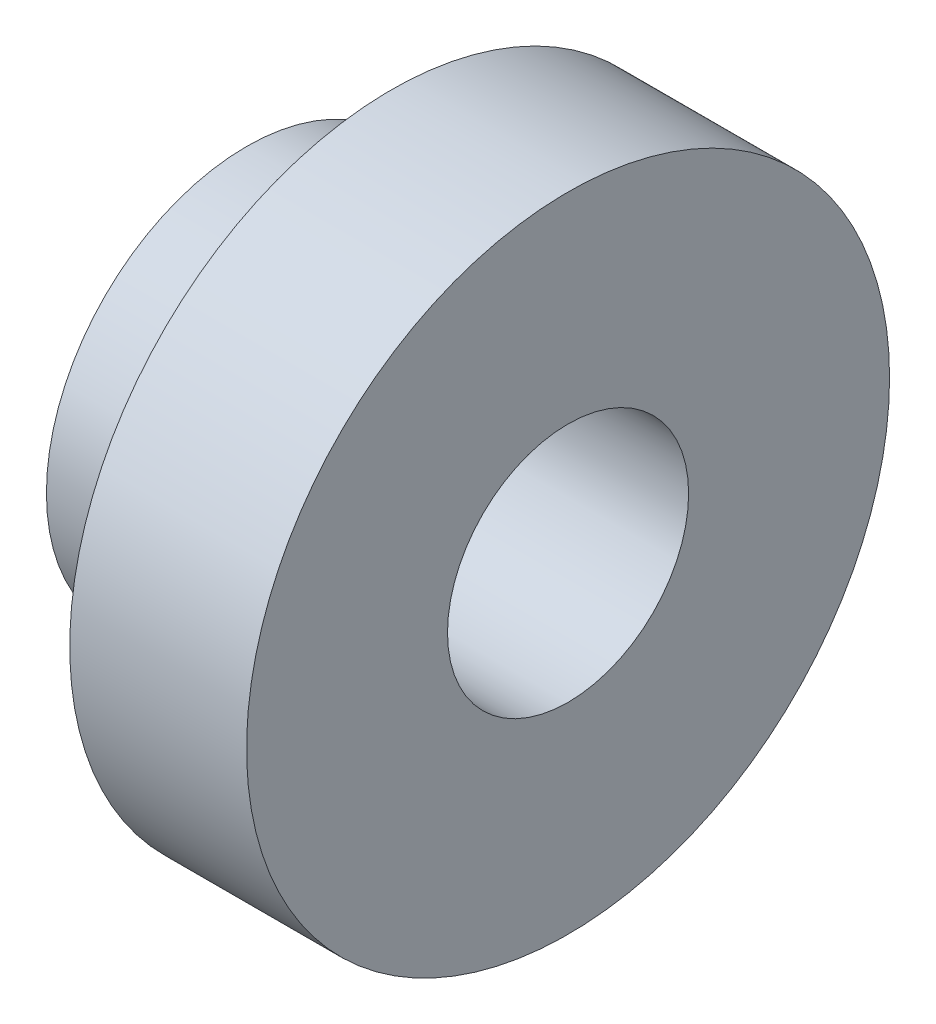
ISO-10303-21;
HEADER;
FILE_DESCRIPTION(('STEP AP214'),'2;1');
FILE_NAME('part.step','',(''),(''),'','','');
FILE_SCHEMA(('AUTOMOTIVE_DESIGN { 1 0 10303 214 1 1 1 1 }'));
ENDSEC;
DATA;
#1=APPLICATION_CONTEXT('core data for automotive mechanical design processes');
#2=APPLICATION_PROTOCOL_DEFINITION('international standard','automotive_design',2000,#1);
#3=PRODUCT_CONTEXT('',#1,'mechanical');
#4=PRODUCT('Part','Part','',(#3));
#5=PRODUCT_RELATED_PRODUCT_CATEGORY('part','',(#4));
#6=PRODUCT_DEFINITION_FORMATION('','',#4);
#7=PRODUCT_DEFINITION_CONTEXT('part definition',#1,'design');
#8=PRODUCT_DEFINITION('design','',#6,#7);
#9=PRODUCT_DEFINITION_SHAPE('','',#8);
#10=(LENGTH_UNIT() NAMED_UNIT(*) SI_UNIT(.MILLI.,.METRE.));
#11=(NAMED_UNIT(*) PLANE_ANGLE_UNIT() SI_UNIT($,.RADIAN.));
#12=(NAMED_UNIT(*) SI_UNIT($,.STERADIAN.) SOLID_ANGLE_UNIT());
#13=UNCERTAINTY_MEASURE_WITH_UNIT(LENGTH_MEASURE(1.E-05),#10,'distance_accuracy_value','');
#14=(GEOMETRIC_REPRESENTATION_CONTEXT(3) GLOBAL_UNCERTAINTY_ASSIGNED_CONTEXT((#13)) GLOBAL_UNIT_ASSIGNED_CONTEXT((#10,
#11,#12)) REPRESENTATION_CONTEXT('',''));
#15=CARTESIAN_POINT('',(0.,0.,0.));
#16=DIRECTION('',(0.,0.,1.));
#17=DIRECTION('',(1.,0.,0.));
#18=AXIS2_PLACEMENT_3D('',#15,#16,#17);
#19=CARTESIAN_POINT('',(0.,-2.54142135623731,0.));
#20=DIRECTION('',(-1.,0.,0.));
#21=DIRECTION('',(0.,0.,1.));
#22=AXIS2_PLACEMENT_3D('',#19,#20,#21);
#23=PLANE('',#22);
#24=CARTESIAN_POINT('',(0.,0.,0.));
#25=DIRECTION('',(1.,0.,0.));
#26=DIRECTION('',(0.,0.,-1.));
#27=AXIS2_PLACEMENT_3D('',#24,#25,#26);
#28=CIRCLE('',#27,1.5);
#29=CARTESIAN_POINT('',(0.,0.,-1.5));
#30=VERTEX_POINT('',#29);
#31=EDGE_CURVE('E46',#30,#30,#28,.T.);
#32=ORIENTED_EDGE('',*,*,#31,.F.);
#33=EDGE_LOOP('',(#32));
#34=FACE_BOUND('',#33,.T.);
#35=CARTESIAN_POINT('',(0.,0.,0.));
#36=DIRECTION('',(1.,0.,0.));
#37=DIRECTION('',(0.,0.,-1.));
#38=AXIS2_PLACEMENT_3D('',#35,#36,#37);
#39=CIRCLE('',#38,4.);
#40=CARTESIAN_POINT('',(0.,0.,-4.));
#41=VERTEX_POINT('',#40);
#42=EDGE_CURVE('E10',#41,#41,#39,.T.);
#43=ORIENTED_EDGE('',*,*,#42,.T.);
#44=EDGE_LOOP('',(#43));
#45=FACE_BOUND('',#44,.T.);
#46=ADVANCED_FACE('F24',(#34,#45),#23,.F.);
#47=CARTESIAN_POINT('',(0.,0.,0.));
#48=DIRECTION('',(1.,0.,0.));
#49=DIRECTION('',(0.,0.,-1.));
#50=AXIS2_PLACEMENT_3D('',#47,#48,#49);
#51=CYLINDRICAL_SURFACE('',#50,4.);
#52=ORIENTED_EDGE('',*,*,#42,.F.);
#53=EDGE_LOOP('',(#52));
#54=FACE_BOUND('',#53,.T.);
#55=CARTESIAN_POINT('',(-2.2,0.,0.));
#56=DIRECTION('',(1.,0.,0.));
#57=DIRECTION('',(0.,0.,-1.));
#58=AXIS2_PLACEMENT_3D('',#55,#56,#57);
#59=CIRCLE('',#58,4.);
#60=CARTESIAN_POINT('',(-2.2,0.,-4.));
#61=VERTEX_POINT('',#60);
#62=EDGE_CURVE('E30',#61,#61,#59,.T.);
#63=ORIENTED_EDGE('',*,*,#62,.T.);
#64=EDGE_LOOP('',(#63));
#65=FACE_BOUND('',#64,.T.);
#66=ADVANCED_FACE('F53',(#54,#65),#51,.T.);
#67=CARTESIAN_POINT('',(-2.2,-2.54142135623731,0.));
#68=DIRECTION('',(1.,0.,0.));
#69=DIRECTION('',(0.,0.,-1.));
#70=AXIS2_PLACEMENT_3D('',#67,#68,#69);
#71=PLANE('',#70);
#72=ORIENTED_EDGE('',*,*,#62,.F.);
#73=EDGE_LOOP('',(#72));
#74=FACE_BOUND('',#73,.T.);
#75=CARTESIAN_POINT('',(-2.2,0.,0.));
#76=DIRECTION('',(1.,0.,0.));
#77=DIRECTION('',(0.,0.,-1.));
#78=AXIS2_PLACEMENT_3D('',#75,#76,#77);
#79=CIRCLE('',#78,2.48999999999999);
#80=CARTESIAN_POINT('',(-2.2,0.,-2.48999999999999));
#81=VERTEX_POINT('',#80);
#82=EDGE_CURVE('E34',#81,#81,#79,.T.);
#83=ORIENTED_EDGE('',*,*,#82,.T.);
#84=EDGE_LOOP('',(#83));
#85=FACE_BOUND('',#84,.T.);
#86=ADVANCED_FACE('F57',(#74,#85),#71,.F.);
#87=CARTESIAN_POINT('',(0.,0.,0.));
#88=DIRECTION('',(1.,0.,0.));
#89=DIRECTION('',(0.,0.,-1.));
#90=AXIS2_PLACEMENT_3D('',#87,#88,#89);
#91=CYLINDRICAL_SURFACE('',#90,2.49);
#92=ORIENTED_EDGE('',*,*,#82,.F.);
#93=EDGE_LOOP('',(#92));
#94=FACE_BOUND('',#93,.T.);
#95=CARTESIAN_POINT('',(-4.,0.,0.));
#96=DIRECTION('',(1.,0.,0.));
#97=DIRECTION('',(0.,0.,-1.));
#98=AXIS2_PLACEMENT_3D('',#95,#96,#97);
#99=CIRCLE('',#98,2.49);
#100=CARTESIAN_POINT('',(-4.,0.,-2.49));
#101=VERTEX_POINT('',#100);
#102=EDGE_CURVE('E38',#101,#101,#99,.T.);
#103=ORIENTED_EDGE('',*,*,#102,.T.);
#104=EDGE_LOOP('',(#103));
#105=FACE_BOUND('',#104,.T.);
#106=ADVANCED_FACE('F62',(#94,#105),#91,.T.);
#107=CARTESIAN_POINT('',(-4.,-2.54142135623731,0.));
#108=DIRECTION('',(1.,0.,0.));
#109=DIRECTION('',(0.,0.,-1.));
#110=AXIS2_PLACEMENT_3D('',#107,#108,#109);
#111=PLANE('',#110);
#112=ORIENTED_EDGE('',*,*,#102,.F.);
#113=EDGE_LOOP('',(#112));
#114=FACE_BOUND('',#113,.T.);
#115=CARTESIAN_POINT('',(-4.,0.,0.));
#116=DIRECTION('',(1.,0.,0.));
#117=DIRECTION('',(0.,0.,-1.));
#118=AXIS2_PLACEMENT_3D('',#115,#116,#117);
#119=CIRCLE('',#118,1.5);
#120=CARTESIAN_POINT('',(-4.,0.,-1.5));
#121=VERTEX_POINT('',#120);
#122=EDGE_CURVE('E43',#121,#121,#119,.T.);
#123=ORIENTED_EDGE('',*,*,#122,.T.);
#124=EDGE_LOOP('',(#123));
#125=FACE_BOUND('',#124,.T.);
#126=ADVANCED_FACE('F68',(#114,#125),#111,.F.);
#127=CARTESIAN_POINT('',(0.,0.,0.));
#128=DIRECTION('',(1.,0.,0.));
#129=DIRECTION('',(0.,0.,-1.));
#130=AXIS2_PLACEMENT_3D('',#127,#128,#129);
#131=CYLINDRICAL_SURFACE('',#130,1.5);
#132=ORIENTED_EDGE('',*,*,#122,.F.);
#133=EDGE_LOOP('',(#132));
#134=FACE_BOUND('',#133,.T.);
#135=ORIENTED_EDGE('',*,*,#31,.T.);
#136=EDGE_LOOP('',(#135));
#137=FACE_BOUND('',#136,.T.);
#138=ADVANCED_FACE('F50',(#134,#137),#131,.F.);
#139=CLOSED_SHELL('',(#46,#66,#86,#106,#126,#138));
#140=MANIFOLD_SOLID_BREP('B2',#139);
#141=ADVANCED_BREP_SHAPE_REPRESENTATION('',(#18,#140),#14);
#142=SHAPE_DEFINITION_REPRESENTATION(#9,#141);
ENDSEC;
END-ISO-10303-21;
